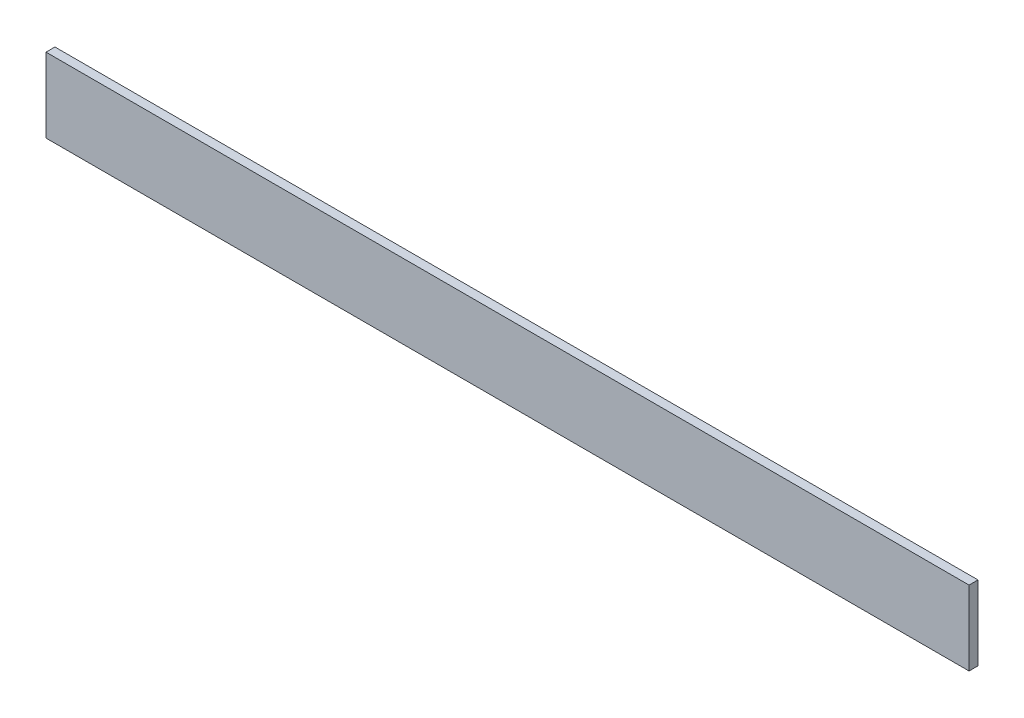
ISO-10303-21;
HEADER;
FILE_DESCRIPTION(('STEP AP214'),'2;1');
FILE_NAME('part.step','',(''),(''),'','','');
FILE_SCHEMA(('AUTOMOTIVE_DESIGN { 1 0 10303 214 1 1 1 1 }'));
ENDSEC;
DATA;
#1=APPLICATION_CONTEXT('core data for automotive mechanical design processes');
#2=APPLICATION_PROTOCOL_DEFINITION('international standard','automotive_design',2000,#1);
#3=PRODUCT_CONTEXT('',#1,'mechanical');
#4=PRODUCT('Part','Part','',(#3));
#5=PRODUCT_RELATED_PRODUCT_CATEGORY('part','',(#4));
#6=PRODUCT_DEFINITION_FORMATION('','',#4);
#7=PRODUCT_DEFINITION_CONTEXT('part definition',#1,'design');
#8=PRODUCT_DEFINITION('design','',#6,#7);
#9=PRODUCT_DEFINITION_SHAPE('','',#8);
#10=(LENGTH_UNIT() NAMED_UNIT(*) SI_UNIT(.MILLI.,.METRE.));
#11=(NAMED_UNIT(*) PLANE_ANGLE_UNIT() SI_UNIT($,.RADIAN.));
#12=(NAMED_UNIT(*) SI_UNIT($,.STERADIAN.) SOLID_ANGLE_UNIT());
#13=UNCERTAINTY_MEASURE_WITH_UNIT(LENGTH_MEASURE(1.E-05),#10,'distance_accuracy_value','');
#14=(GEOMETRIC_REPRESENTATION_CONTEXT(3) GLOBAL_UNCERTAINTY_ASSIGNED_CONTEXT((#13)) GLOBAL_UNIT_ASSIGNED_CONTEXT((#10,
#11,#12)) REPRESENTATION_CONTEXT('',''));
#15=CARTESIAN_POINT('',(0.,0.,0.));
#16=DIRECTION('',(0.,0.,1.));
#17=DIRECTION('',(1.,0.,0.));
#18=AXIS2_PLACEMENT_3D('',#15,#16,#17);
#19=CARTESIAN_POINT('',(310.,0.,-3.));
#20=DIRECTION('',(0.,0.,1.));
#21=DIRECTION('',(1.,0.,0.));
#22=AXIS2_PLACEMENT_3D('',#19,#20,#21);
#23=PLANE('',#22);
#24=DIRECTION('',(0.,1.,0.));
#25=VECTOR('',#24,1.);
#26=CARTESIAN_POINT('',(0.,0.,-3.));
#27=LINE('',#26,#25);
#28=CARTESIAN_POINT('',(0.,3.,-3.));
#29=VERTEX_POINT('',#28);
#30=CARTESIAN_POINT('',(0.,25.,-3.));
#31=VERTEX_POINT('',#30);
#32=EDGE_CURVE('E137',#29,#31,#27,.T.);
#33=ORIENTED_EDGE('',*,*,#32,.T.);
#34=DIRECTION('',(-1.,0.,0.));
#35=VECTOR('',#34,1.);
#36=CARTESIAN_POINT('',(310.,25.,-3.));
#37=LINE('',#36,#35);
#38=CARTESIAN_POINT('',(310.,25.,-3.));
#39=VERTEX_POINT('',#38);
#40=EDGE_CURVE('E42',#39,#31,#37,.T.);
#41=ORIENTED_EDGE('',*,*,#40,.F.);
#42=DIRECTION('',(0.,1.,0.));
#43=VECTOR('',#42,1.);
#44=CARTESIAN_POINT('',(310.,0.,-3.));
#45=LINE('',#44,#43);
#46=CARTESIAN_POINT('',(310.,0.,-3.));
#47=VERTEX_POINT('',#46);
#48=EDGE_CURVE('E85',#47,#39,#45,.T.);
#49=ORIENTED_EDGE('',*,*,#48,.F.);
#50=DIRECTION('',(-1.,0.,0.));
#51=VECTOR('',#50,1.);
#52=CARTESIAN_POINT('',(288.,0.,-3.));
#53=LINE('',#52,#51);
#54=CARTESIAN_POINT('',(288.,0.,-3.));
#55=VERTEX_POINT('',#54);
#56=EDGE_CURVE('E109',#47,#55,#53,.T.);
#57=ORIENTED_EDGE('',*,*,#56,.T.);
#58=DIRECTION('',(0.,-1.,0.));
#59=VECTOR('',#58,1.);
#60=CARTESIAN_POINT('',(288.,25.,-3.));
#61=LINE('',#60,#59);
#62=CARTESIAN_POINT('',(288.,3.,-3.));
#63=VERTEX_POINT('',#62);
#64=EDGE_CURVE('E106',#63,#55,#61,.T.);
#65=ORIENTED_EDGE('',*,*,#64,.F.);
#66=DIRECTION('',(-1.,0.,0.));
#67=VECTOR('',#66,1.);
#68=CARTESIAN_POINT('',(310.,3.,-3.));
#69=LINE('',#68,#67);
#70=EDGE_CURVE('E80',#63,#29,#69,.T.);
#71=ORIENTED_EDGE('',*,*,#70,.T.);
#72=EDGE_LOOP('',(#33,#41,#49,#57,#65,#71));
#73=FACE_BOUND('',#72,.T.);
#74=ADVANCED_FACE('F34',(#73),#23,.F.);
#75=CARTESIAN_POINT('',(310.,25.,0.));
#76=DIRECTION('',(0.,1.,0.));
#77=DIRECTION('',(0.,0.,1.));
#78=AXIS2_PLACEMENT_3D('',#75,#76,#77);
#79=PLANE('',#78);
#80=DIRECTION('',(0.,0.,-1.));
#81=VECTOR('',#80,1.);
#82=CARTESIAN_POINT('',(0.,25.,0.));
#83=LINE('',#82,#81);
#84=CARTESIAN_POINT('',(0.,25.,0.));
#85=VERTEX_POINT('',#84);
#86=EDGE_CURVE('E133',#85,#31,#83,.T.);
#87=ORIENTED_EDGE('',*,*,#86,.F.);
#88=DIRECTION('',(-1.,0.,0.));
#89=VECTOR('',#88,1.);
#90=CARTESIAN_POINT('',(310.,25.,0.));
#91=LINE('',#90,#89);
#92=CARTESIAN_POINT('',(310.,25.,0.));
#93=VERTEX_POINT('',#92);
#94=EDGE_CURVE('E123',#93,#85,#91,.T.);
#95=ORIENTED_EDGE('',*,*,#94,.F.);
#96=DIRECTION('',(0.,0.,-1.));
#97=VECTOR('',#96,1.);
#98=CARTESIAN_POINT('',(310.,25.,0.));
#99=LINE('',#98,#97);
#100=EDGE_CURVE('E135',#93,#39,#99,.T.);
#101=ORIENTED_EDGE('',*,*,#100,.T.);
#102=ORIENTED_EDGE('',*,*,#40,.T.);
#103=EDGE_LOOP('',(#87,#95,#101,#102));
#104=FACE_BOUND('',#103,.T.);
#105=ADVANCED_FACE('F131',(#104),#79,.T.);
#106=CARTESIAN_POINT('',(310.,0.,0.));
#107=DIRECTION('',(0.,0.,1.));
#108=DIRECTION('',(1.,0.,0.));
#109=AXIS2_PLACEMENT_3D('',#106,#107,#108);
#110=PLANE('',#109);
#111=DIRECTION('',(0.,1.,0.));
#112=VECTOR('',#111,1.);
#113=CARTESIAN_POINT('',(0.,0.,0.));
#114=LINE('',#113,#112);
#115=CARTESIAN_POINT('',(0.,0.,0.));
#116=VERTEX_POINT('',#115);
#117=EDGE_CURVE('E142',#116,#85,#114,.T.);
#118=ORIENTED_EDGE('',*,*,#117,.F.);
#119=DIRECTION('',(-1.,0.,0.));
#120=VECTOR('',#119,1.);
#121=CARTESIAN_POINT('',(310.,0.,0.));
#122=LINE('',#121,#120);
#123=CARTESIAN_POINT('',(310.,0.,0.));
#124=VERTEX_POINT('',#123);
#125=EDGE_CURVE('E121',#124,#116,#122,.T.);
#126=ORIENTED_EDGE('',*,*,#125,.F.);
#127=DIRECTION('',(0.,1.,0.));
#128=VECTOR('',#127,1.);
#129=CARTESIAN_POINT('',(310.,0.,0.));
#130=LINE('',#129,#128);
#131=EDGE_CURVE('E151',#124,#93,#130,.T.);
#132=ORIENTED_EDGE('',*,*,#131,.T.);
#133=ORIENTED_EDGE('',*,*,#94,.T.);
#134=EDGE_LOOP('',(#118,#126,#132,#133));
#135=FACE_BOUND('',#134,.T.);
#136=ADVANCED_FACE('F161',(#135),#110,.T.);
#137=CARTESIAN_POINT('',(310.,0.,0.));
#138=DIRECTION('',(0.,-1.,0.));
#139=DIRECTION('',(0.,0.,-1.));
#140=AXIS2_PLACEMENT_3D('',#137,#138,#139);
#141=PLANE('',#140);
#142=DIRECTION('',(0.,0.,-1.));
#143=VECTOR('',#142,1.);
#144=CARTESIAN_POINT('',(288.,0.,-25.));
#145=LINE('',#144,#143);
#146=CARTESIAN_POINT('',(288.,0.,-25.));
#147=VERTEX_POINT('',#146);
#148=EDGE_CURVE('E102',#55,#147,#145,.T.);
#149=ORIENTED_EDGE('',*,*,#148,.F.);
#150=ORIENTED_EDGE('',*,*,#56,.F.);
#151=DIRECTION('',(0.,0.,1.));
#152=VECTOR('',#151,1.);
#153=CARTESIAN_POINT('',(310.,0.,0.));
#154=LINE('',#153,#152);
#155=EDGE_CURVE('E50',#47,#124,#154,.T.);
#156=ORIENTED_EDGE('',*,*,#155,.T.);
#157=ORIENTED_EDGE('',*,*,#125,.T.);
#158=DIRECTION('',(0.,0.,1.));
#159=VECTOR('',#158,1.);
#160=CARTESIAN_POINT('',(0.,0.,0.));
#161=LINE('',#160,#159);
#162=CARTESIAN_POINT('',(0.,0.,-25.));
#163=VERTEX_POINT('',#162);
#164=EDGE_CURVE('E119',#163,#116,#161,.T.);
#165=ORIENTED_EDGE('',*,*,#164,.F.);
#166=DIRECTION('',(-1.,0.,0.));
#167=VECTOR('',#166,1.);
#168=CARTESIAN_POINT('',(310.,0.,-25.));
#169=LINE('',#168,#167);
#170=EDGE_CURVE('E114',#147,#163,#169,.T.);
#171=ORIENTED_EDGE('',*,*,#170,.F.);
#172=EDGE_LOOP('',(#149,#150,#156,#157,#165,#171));
#173=FACE_BOUND('',#172,.T.);
#174=ADVANCED_FACE('F117',(#173),#141,.T.);
#175=CARTESIAN_POINT('',(310.,3.,-25.));
#176=DIRECTION('',(0.,0.,-1.));
#177=DIRECTION('',(-1.,0.,0.));
#178=AXIS2_PLACEMENT_3D('',#175,#176,#177);
#179=PLANE('',#178);
#180=DIRECTION('',(0.,-1.,0.));
#181=VECTOR('',#180,1.);
#182=CARTESIAN_POINT('',(288.,25.,-25.));
#183=LINE('',#182,#181);
#184=CARTESIAN_POINT('',(288.,3.,-25.));
#185=VERTEX_POINT('',#184);
#186=EDGE_CURVE('E105',#185,#147,#183,.T.);
#187=ORIENTED_EDGE('',*,*,#186,.T.);
#188=ORIENTED_EDGE('',*,*,#170,.T.);
#189=DIRECTION('',(0.,-1.,0.));
#190=VECTOR('',#189,1.);
#191=CARTESIAN_POINT('',(0.,3.,-25.));
#192=LINE('',#191,#190);
#193=CARTESIAN_POINT('',(0.,3.,-25.));
#194=VERTEX_POINT('',#193);
#195=EDGE_CURVE('E148',#194,#163,#192,.T.);
#196=ORIENTED_EDGE('',*,*,#195,.F.);
#197=DIRECTION('',(-1.,0.,0.));
#198=VECTOR('',#197,1.);
#199=CARTESIAN_POINT('',(310.,3.,-25.));
#200=LINE('',#199,#198);
#201=EDGE_CURVE('E73',#185,#194,#200,.T.);
#202=ORIENTED_EDGE('',*,*,#201,.F.);
#203=EDGE_LOOP('',(#187,#188,#196,#202));
#204=FACE_BOUND('',#203,.T.);
#205=ADVANCED_FACE('F112',(#204),#179,.T.);
#206=CARTESIAN_POINT('',(310.,3.,0.));
#207=DIRECTION('',(0.,-1.,0.));
#208=DIRECTION('',(0.,0.,-1.));
#209=AXIS2_PLACEMENT_3D('',#206,#207,#208);
#210=PLANE('',#209);
#211=ORIENTED_EDGE('',*,*,#70,.F.);
#212=DIRECTION('',(0.,0.,-1.));
#213=VECTOR('',#212,1.);
#214=CARTESIAN_POINT('',(288.,3.,0.));
#215=LINE('',#214,#213);
#216=EDGE_CURVE('E11',#63,#185,#215,.T.);
#217=ORIENTED_EDGE('',*,*,#216,.T.);
#218=ORIENTED_EDGE('',*,*,#201,.T.);
#219=DIRECTION('',(0.,0.,-1.));
#220=VECTOR('',#219,1.);
#221=CARTESIAN_POINT('',(0.,3.,0.));
#222=LINE('',#221,#220);
#223=EDGE_CURVE('E150',#194,#29,#222,.F.);
#224=ORIENTED_EDGE('',*,*,#223,.T.);
#225=EDGE_LOOP('',(#211,#217,#218,#224));
#226=FACE_BOUND('',#225,.T.);
#227=ADVANCED_FACE('F162',(#226),#210,.F.);
#228=CARTESIAN_POINT('',(310.,0.,0.));
#229=DIRECTION('',(-1.,0.,0.));
#230=DIRECTION('',(0.,0.,1.));
#231=AXIS2_PLACEMENT_3D('',#228,#229,#230);
#232=PLANE('',#231);
#233=ORIENTED_EDGE('',*,*,#155,.F.);
#234=ORIENTED_EDGE('',*,*,#48,.T.);
#235=ORIENTED_EDGE('',*,*,#100,.F.);
#236=ORIENTED_EDGE('',*,*,#131,.F.);
#237=EDGE_LOOP('',(#233,#234,#235,#236));
#238=FACE_BOUND('',#237,.T.);
#239=ADVANCED_FACE('F159',(#238),#232,.F.);
#240=CARTESIAN_POINT('',(0.,0.,0.));
#241=DIRECTION('',(-1.,0.,0.));
#242=DIRECTION('',(0.,0.,1.));
#243=AXIS2_PLACEMENT_3D('',#240,#241,#242);
#244=PLANE('',#243);
#245=ORIENTED_EDGE('',*,*,#32,.F.);
#246=ORIENTED_EDGE('',*,*,#223,.F.);
#247=ORIENTED_EDGE('',*,*,#195,.T.);
#248=ORIENTED_EDGE('',*,*,#164,.T.);
#249=ORIENTED_EDGE('',*,*,#117,.T.);
#250=ORIENTED_EDGE('',*,*,#86,.T.);
#251=EDGE_LOOP('',(#245,#246,#247,#248,#249,#250));
#252=FACE_BOUND('',#251,.T.);
#253=ADVANCED_FACE('F140',(#252),#244,.T.);
#254=CARTESIAN_POINT('',(288.,25.,-25.));
#255=DIRECTION('',(-1.,0.,0.));
#256=DIRECTION('',(0.,0.,1.));
#257=AXIS2_PLACEMENT_3D('',#254,#255,#256);
#258=PLANE('',#257);
#259=ORIENTED_EDGE('',*,*,#64,.T.);
#260=ORIENTED_EDGE('',*,*,#148,.T.);
#261=ORIENTED_EDGE('',*,*,#186,.F.);
#262=ORIENTED_EDGE('',*,*,#216,.F.);
#263=EDGE_LOOP('',(#259,#260,#261,#262));
#264=FACE_BOUND('',#263,.T.);
#265=ADVANCED_FACE('F104',(#264),#258,.F.);
#266=CLOSED_SHELL('',(#74,#105,#136,#174,#205,#227,#239,#253,#265));
#267=MANIFOLD_SOLID_BREP('B2',#266);
#268=ADVANCED_BREP_SHAPE_REPRESENTATION('',(#18,#267),#14);
#269=SHAPE_DEFINITION_REPRESENTATION(#9,#268);
ENDSEC;
END-ISO-10303-21;
